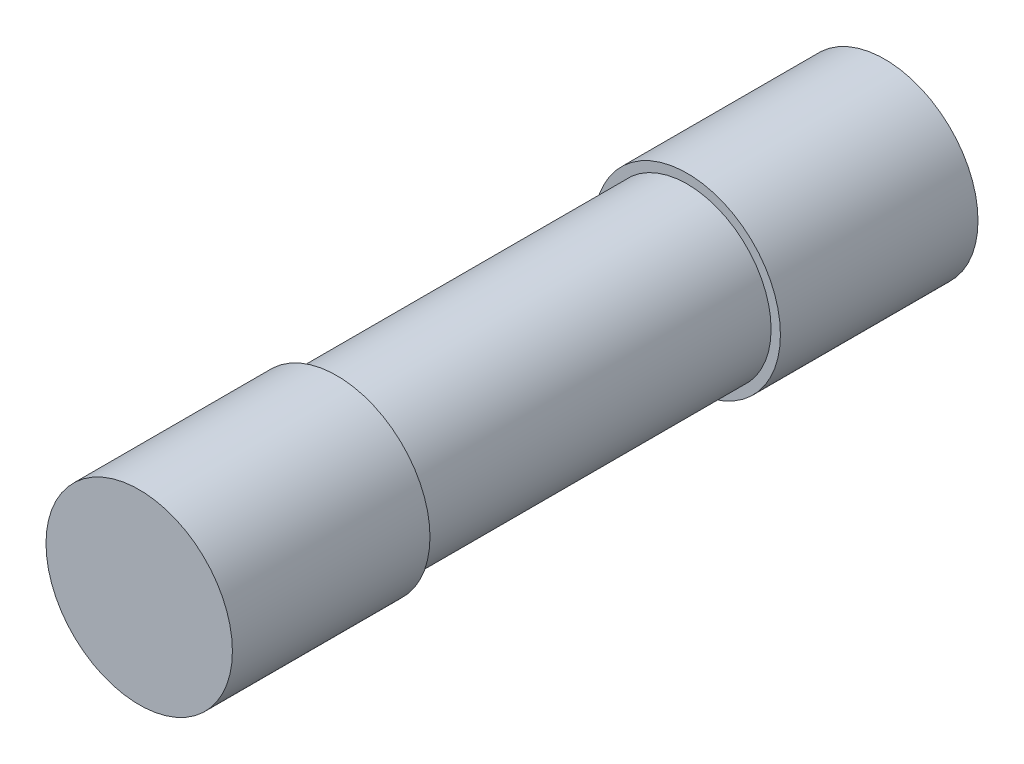
ISO-10303-21;
HEADER;
FILE_DESCRIPTION(('STEP AP214'),'2;1');
FILE_NAME('part.step','',(''),(''),'','','');
FILE_SCHEMA(('AUTOMOTIVE_DESIGN { 1 0 10303 214 1 1 1 1 }'));
ENDSEC;
DATA;
#1=APPLICATION_CONTEXT('core data for automotive mechanical design processes');
#2=APPLICATION_PROTOCOL_DEFINITION('international standard','automotive_design',2000,#1);
#3=PRODUCT_CONTEXT('',#1,'mechanical');
#4=PRODUCT('Part','Part','',(#3));
#5=PRODUCT_RELATED_PRODUCT_CATEGORY('part','',(#4));
#6=PRODUCT_DEFINITION_FORMATION('','',#4);
#7=PRODUCT_DEFINITION_CONTEXT('part definition',#1,'design');
#8=PRODUCT_DEFINITION('design','',#6,#7);
#9=PRODUCT_DEFINITION_SHAPE('','',#8);
#10=(LENGTH_UNIT() NAMED_UNIT(*) SI_UNIT(.MILLI.,.METRE.));
#11=(NAMED_UNIT(*) PLANE_ANGLE_UNIT() SI_UNIT($,.RADIAN.));
#12=(NAMED_UNIT(*) SI_UNIT($,.STERADIAN.) SOLID_ANGLE_UNIT());
#13=UNCERTAINTY_MEASURE_WITH_UNIT(LENGTH_MEASURE(1.E-05),#10,'distance_accuracy_value','');
#14=(GEOMETRIC_REPRESENTATION_CONTEXT(3) GLOBAL_UNCERTAINTY_ASSIGNED_CONTEXT((#13)) GLOBAL_UNIT_ASSIGNED_CONTEXT((#10,
#11,#12)) REPRESENTATION_CONTEXT('',''));
#15=CARTESIAN_POINT('',(0.,0.,0.));
#16=DIRECTION('',(0.,0.,1.));
#17=DIRECTION('',(1.,0.,0.));
#18=AXIS2_PLACEMENT_3D('',#15,#16,#17);
#19=CARTESIAN_POINT('',(0.,0.,20.));
#20=DIRECTION('',(0.,0.,-1.));
#21=DIRECTION('',(-1.,0.,0.));
#22=AXIS2_PLACEMENT_3D('',#19,#20,#21);
#23=CYLINDRICAL_SURFACE('',#22,2.25);
#24=CARTESIAN_POINT('',(0.,0.,14.7));
#25=DIRECTION('',(0.,0.,-1.));
#26=DIRECTION('',(-1.,0.,0.));
#27=AXIS2_PLACEMENT_3D('',#24,#25,#26);
#28=CIRCLE('',#27,2.25);
#29=CARTESIAN_POINT('',(-2.25,0.,14.7));
#30=VERTEX_POINT('',#29);
#31=EDGE_CURVE('E35',#30,#30,#28,.T.);
#32=ORIENTED_EDGE('',*,*,#31,.T.);
#33=EDGE_LOOP('',(#32));
#34=FACE_BOUND('',#33,.T.);
#35=CARTESIAN_POINT('',(0.,0.,5.3));
#36=DIRECTION('',(0.,0.,-1.));
#37=DIRECTION('',(-1.,0.,0.));
#38=AXIS2_PLACEMENT_3D('',#35,#36,#37);
#39=CIRCLE('',#38,2.25);
#40=CARTESIAN_POINT('',(-2.25,0.,5.3));
#41=VERTEX_POINT('',#40);
#42=EDGE_CURVE('E10',#41,#41,#39,.T.);
#43=ORIENTED_EDGE('',*,*,#42,.F.);
#44=EDGE_LOOP('',(#43));
#45=FACE_BOUND('',#44,.T.);
#46=ADVANCED_FACE('F32',(#34,#45),#23,.T.);
#47=CARTESIAN_POINT('',(0.,0.,5.3));
#48=DIRECTION('',(0.,0.,-1.));
#49=DIRECTION('',(-1.,0.,0.));
#50=AXIS2_PLACEMENT_3D('',#47,#48,#49);
#51=PLANE('',#50);
#52=CARTESIAN_POINT('',(0.,0.,5.3));
#53=DIRECTION('',(0.,0.,-1.));
#54=DIRECTION('',(-1.,0.,0.));
#55=AXIS2_PLACEMENT_3D('',#52,#53,#54);
#56=CIRCLE('',#55,2.5);
#57=CARTESIAN_POINT('',(-2.5,0.,5.3));
#58=VERTEX_POINT('',#57);
#59=EDGE_CURVE('E39',#58,#58,#56,.T.);
#60=ORIENTED_EDGE('',*,*,#59,.F.);
#61=EDGE_LOOP('',(#60));
#62=FACE_BOUND('',#61,.T.);
#63=ORIENTED_EDGE('',*,*,#42,.T.);
#64=EDGE_LOOP('',(#63));
#65=FACE_BOUND('',#64,.T.);
#66=ADVANCED_FACE('F75',(#62,#65),#51,.F.);
#67=CARTESIAN_POINT('',(0.,0.,5.3));
#68=DIRECTION('',(0.,0.,-1.));
#69=DIRECTION('',(-1.,0.,0.));
#70=AXIS2_PLACEMENT_3D('',#67,#68,#69);
#71=CYLINDRICAL_SURFACE('',#70,2.5);
#72=ORIENTED_EDGE('',*,*,#59,.T.);
#73=EDGE_LOOP('',(#72));
#74=FACE_BOUND('',#73,.T.);
#75=CARTESIAN_POINT('',(0.,0.,0.));
#76=DIRECTION('',(0.,0.,-1.));
#77=DIRECTION('',(-1.,0.,0.));
#78=AXIS2_PLACEMENT_3D('',#75,#76,#77);
#79=CIRCLE('',#78,2.5);
#80=CARTESIAN_POINT('',(-2.5,0.,0.));
#81=VERTEX_POINT('',#80);
#82=EDGE_CURVE('E43',#81,#81,#79,.T.);
#83=ORIENTED_EDGE('',*,*,#82,.F.);
#84=EDGE_LOOP('',(#83));
#85=FACE_BOUND('',#84,.T.);
#86=ADVANCED_FACE('F72',(#74,#85),#71,.T.);
#87=CARTESIAN_POINT('',(0.,0.,0.));
#88=DIRECTION('',(0.,0.,1.));
#89=DIRECTION('',(1.,0.,0.));
#90=AXIS2_PLACEMENT_3D('',#87,#88,#89);
#91=PLANE('',#90);
#92=ORIENTED_EDGE('',*,*,#82,.T.);
#93=EDGE_LOOP('',(#92));
#94=FACE_BOUND('',#93,.T.);
#95=ADVANCED_FACE('F63',(#94),#91,.F.);
#96=CARTESIAN_POINT('',(0.,0.,14.7));
#97=DIRECTION('',(0.,0.,-1.));
#98=DIRECTION('',(-1.,0.,0.));
#99=AXIS2_PLACEMENT_3D('',#96,#97,#98);
#100=PLANE('',#99);
#101=CARTESIAN_POINT('',(0.,0.,14.7));
#102=DIRECTION('',(0.,0.,-1.));
#103=DIRECTION('',(-1.,0.,0.));
#104=AXIS2_PLACEMENT_3D('',#101,#102,#103);
#105=CIRCLE('',#104,2.5);
#106=CARTESIAN_POINT('',(-2.5,0.,14.7));
#107=VERTEX_POINT('',#106);
#108=EDGE_CURVE('E48',#107,#107,#105,.T.);
#109=ORIENTED_EDGE('',*,*,#108,.T.);
#110=EDGE_LOOP('',(#109));
#111=FACE_BOUND('',#110,.T.);
#112=ORIENTED_EDGE('',*,*,#31,.F.);
#113=EDGE_LOOP('',(#112));
#114=FACE_BOUND('',#113,.T.);
#115=ADVANCED_FACE('F60',(#111,#114),#100,.T.);
#116=CARTESIAN_POINT('',(0.,0.,20.));
#117=DIRECTION('',(0.,0.,-1.));
#118=DIRECTION('',(-1.,0.,0.));
#119=AXIS2_PLACEMENT_3D('',#116,#117,#118);
#120=CYLINDRICAL_SURFACE('',#119,2.5);
#121=CARTESIAN_POINT('',(0.,0.,20.));
#122=DIRECTION('',(0.,0.,-1.));
#123=DIRECTION('',(-1.,0.,0.));
#124=AXIS2_PLACEMENT_3D('',#121,#122,#123);
#125=CIRCLE('',#124,2.5);
#126=CARTESIAN_POINT('',(-2.5,0.,20.));
#127=VERTEX_POINT('',#126);
#128=EDGE_CURVE('E51',#127,#127,#125,.T.);
#129=ORIENTED_EDGE('',*,*,#128,.T.);
#130=EDGE_LOOP('',(#129));
#131=FACE_BOUND('',#130,.T.);
#132=ORIENTED_EDGE('',*,*,#108,.F.);
#133=EDGE_LOOP('',(#132));
#134=FACE_BOUND('',#133,.T.);
#135=ADVANCED_FACE('F62',(#131,#134),#120,.T.);
#136=CARTESIAN_POINT('',(0.,0.,20.));
#137=DIRECTION('',(0.,0.,1.));
#138=DIRECTION('',(1.,0.,0.));
#139=AXIS2_PLACEMENT_3D('',#136,#137,#138);
#140=PLANE('',#139);
#141=ORIENTED_EDGE('',*,*,#128,.F.);
#142=EDGE_LOOP('',(#141));
#143=FACE_BOUND('',#142,.T.);
#144=ADVANCED_FACE('F70',(#143),#140,.T.);
#145=CLOSED_SHELL('',(#46,#66,#86,#95,#115,#135,#144));
#146=MANIFOLD_SOLID_BREP('B2',#145);
#147=ADVANCED_BREP_SHAPE_REPRESENTATION('',(#18,#146),#14);
#148=SHAPE_DEFINITION_REPRESENTATION(#9,#147);
ENDSEC;
END-ISO-10303-21;
